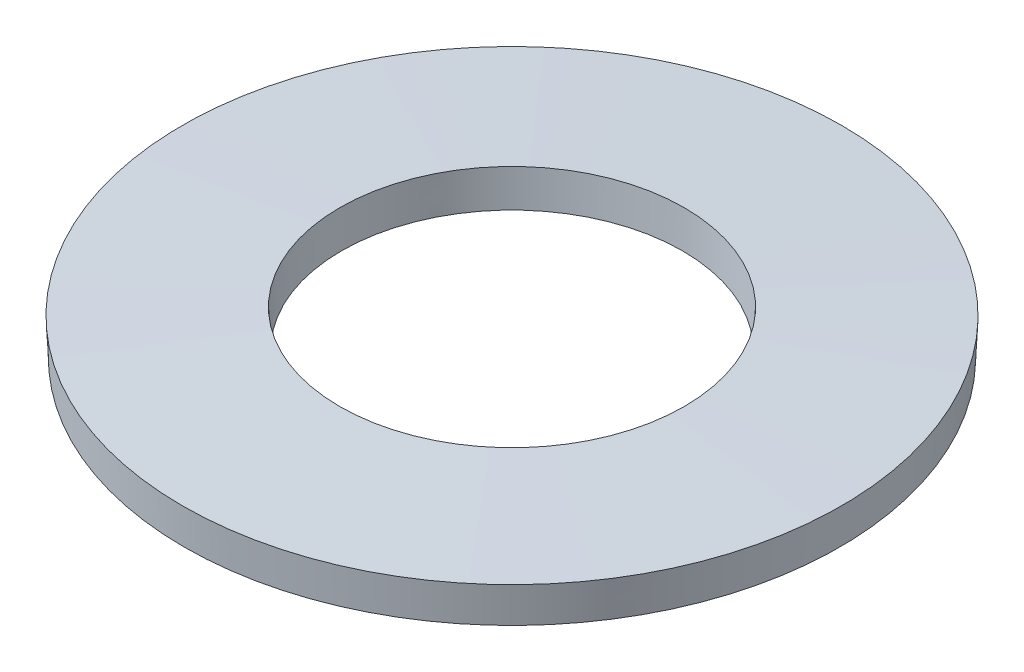
ISO-10303-21;
HEADER;
FILE_DESCRIPTION(('STEP AP214'),'2;1');
FILE_NAME('part.step','',(''),(''),'','','');
FILE_SCHEMA(('AUTOMOTIVE_DESIGN { 1 0 10303 214 1 1 1 1 }'));
ENDSEC;
DATA;
#1=APPLICATION_CONTEXT('core data for automotive mechanical design processes');
#2=APPLICATION_PROTOCOL_DEFINITION('international standard','automotive_design',2000,#1);
#3=PRODUCT_CONTEXT('',#1,'mechanical');
#4=PRODUCT('Part','Part','',(#3));
#5=PRODUCT_RELATED_PRODUCT_CATEGORY('part','',(#4));
#6=PRODUCT_DEFINITION_FORMATION('','',#4);
#7=PRODUCT_DEFINITION_CONTEXT('part definition',#1,'design');
#8=PRODUCT_DEFINITION('design','',#6,#7);
#9=PRODUCT_DEFINITION_SHAPE('','',#8);
#10=(LENGTH_UNIT() NAMED_UNIT(*) SI_UNIT(.MILLI.,.METRE.));
#11=(NAMED_UNIT(*) PLANE_ANGLE_UNIT() SI_UNIT($,.RADIAN.));
#12=(NAMED_UNIT(*) SI_UNIT($,.STERADIAN.) SOLID_ANGLE_UNIT());
#13=UNCERTAINTY_MEASURE_WITH_UNIT(LENGTH_MEASURE(1.E-05),#10,'distance_accuracy_value','');
#14=(GEOMETRIC_REPRESENTATION_CONTEXT(3) GLOBAL_UNCERTAINTY_ASSIGNED_CONTEXT((#13)) GLOBAL_UNIT_ASSIGNED_CONTEXT((#10,
#11,#12)) REPRESENTATION_CONTEXT('',''));
#15=CARTESIAN_POINT('',(0.,0.,0.));
#16=DIRECTION('',(0.,0.,1.));
#17=DIRECTION('',(1.,0.,0.));
#18=AXIS2_PLACEMENT_3D('',#15,#16,#17);
#19=CARTESIAN_POINT('',(0.,1.74808599367797,0.));
#20=DIRECTION('',(0.,1.,0.));
#21=DIRECTION('',(0.,0.,1.));
#22=AXIS2_PLACEMENT_3D('',#19,#20,#21);
#23=CONICAL_SURFACE('',#22,15.75,0.0467742947840993);
#24=CARTESIAN_POINT('',(0.,0.,0.));
#25=DIRECTION('',(0.,-1.,0.));
#26=DIRECTION('',(0.,0.,-1.));
#27=AXIS2_PLACEMENT_3D('',#24,#25,#26);
#28=CIRCLE('',#27,15.668174828403);
#29=CARTESIAN_POINT('',(0.,0.,-15.668174828403));
#30=VERTEX_POINT('',#29);
#31=EDGE_CURVE('E46',#30,#30,#28,.T.);
#32=ORIENTED_EDGE('',*,*,#31,.F.);
#33=EDGE_LOOP('',(#32));
#34=FACE_BOUND('',#33,.T.);
#35=CARTESIAN_POINT('',(0.,1.74808599367797,0.));
#36=DIRECTION('',(0.,-1.,0.));
#37=DIRECTION('',(0.,0.,-1.));
#38=AXIS2_PLACEMENT_3D('',#35,#36,#37);
#39=CIRCLE('',#38,15.75);
#40=CARTESIAN_POINT('',(0.,1.74808599367797,-15.75));
#41=VERTEX_POINT('',#40);
#42=EDGE_CURVE('E10',#41,#41,#39,.T.);
#43=ORIENTED_EDGE('',*,*,#42,.T.);
#44=EDGE_LOOP('',(#43));
#45=FACE_BOUND('',#44,.T.);
#46=ADVANCED_FACE('F32',(#34,#45),#23,.T.);
#47=CARTESIAN_POINT('',(0.,2.1,0.));
#48=DIRECTION('',(0.,-1.,0.));
#49=DIRECTION('',(0.,0.,-1.));
#50=AXIS2_PLACEMENT_3D('',#47,#48,#49);
#51=CONICAL_SURFACE('',#50,8.23182517159704,1.5240220320108);
#52=ORIENTED_EDGE('',*,*,#42,.F.);
#53=EDGE_LOOP('',(#52));
#54=FACE_BOUND('',#53,.T.);
#55=CARTESIAN_POINT('',(0.,2.1,0.));
#56=DIRECTION('',(0.,-1.,0.));
#57=DIRECTION('',(0.,0.,-1.));
#58=AXIS2_PLACEMENT_3D('',#55,#56,#57);
#59=CIRCLE('',#58,8.23182517159704);
#60=CARTESIAN_POINT('',(0.,2.1,-8.23182517159704));
#61=VERTEX_POINT('',#60);
#62=EDGE_CURVE('E38',#61,#61,#59,.T.);
#63=ORIENTED_EDGE('',*,*,#62,.T.);
#64=EDGE_LOOP('',(#63));
#65=FACE_BOUND('',#64,.T.);
#66=ADVANCED_FACE('F55',(#54,#65),#51,.T.);
#67=CARTESIAN_POINT('',(0.,0.351914006322023,0.));
#68=DIRECTION('',(0.,1.,0.));
#69=DIRECTION('',(0.,0.,1.));
#70=AXIS2_PLACEMENT_3D('',#67,#68,#69);
#71=CONICAL_SURFACE('',#70,8.15,0.0467742947840973);
#72=ORIENTED_EDGE('',*,*,#62,.F.);
#73=EDGE_LOOP('',(#72));
#74=FACE_BOUND('',#73,.T.);
#75=CARTESIAN_POINT('',(0.,0.351914006322023,0.));
#76=DIRECTION('',(0.,-1.,0.));
#77=DIRECTION('',(0.,0.,-1.));
#78=AXIS2_PLACEMENT_3D('',#75,#76,#77);
#79=CIRCLE('',#78,8.15);
#80=CARTESIAN_POINT('',(0.,0.351914006322023,-8.15));
#81=VERTEX_POINT('',#80);
#82=EDGE_CURVE('E42',#81,#81,#79,.T.);
#83=ORIENTED_EDGE('',*,*,#82,.T.);
#84=EDGE_LOOP('',(#83));
#85=FACE_BOUND('',#84,.T.);
#86=ADVANCED_FACE('F59',(#74,#85),#71,.F.);
#87=CARTESIAN_POINT('',(0.,0.,0.));
#88=DIRECTION('',(0.,-1.,0.));
#89=DIRECTION('',(0.,0.,-1.));
#90=AXIS2_PLACEMENT_3D('',#87,#88,#89);
#91=CONICAL_SURFACE('',#90,15.668174828403,1.5240220320108);
#92=ORIENTED_EDGE('',*,*,#82,.F.);
#93=EDGE_LOOP('',(#92));
#94=FACE_BOUND('',#93,.T.);
#95=ORIENTED_EDGE('',*,*,#31,.T.);
#96=EDGE_LOOP('',(#95));
#97=FACE_BOUND('',#96,.T.);
#98=ADVANCED_FACE('F52',(#94,#97),#91,.F.);
#99=CLOSED_SHELL('',(#46,#66,#86,#98));
#100=MANIFOLD_SOLID_BREP('B2',#99);
#101=ADVANCED_BREP_SHAPE_REPRESENTATION('',(#18,#100),#14);
#102=SHAPE_DEFINITION_REPRESENTATION(#9,#101);
ENDSEC;
END-ISO-10303-21;
